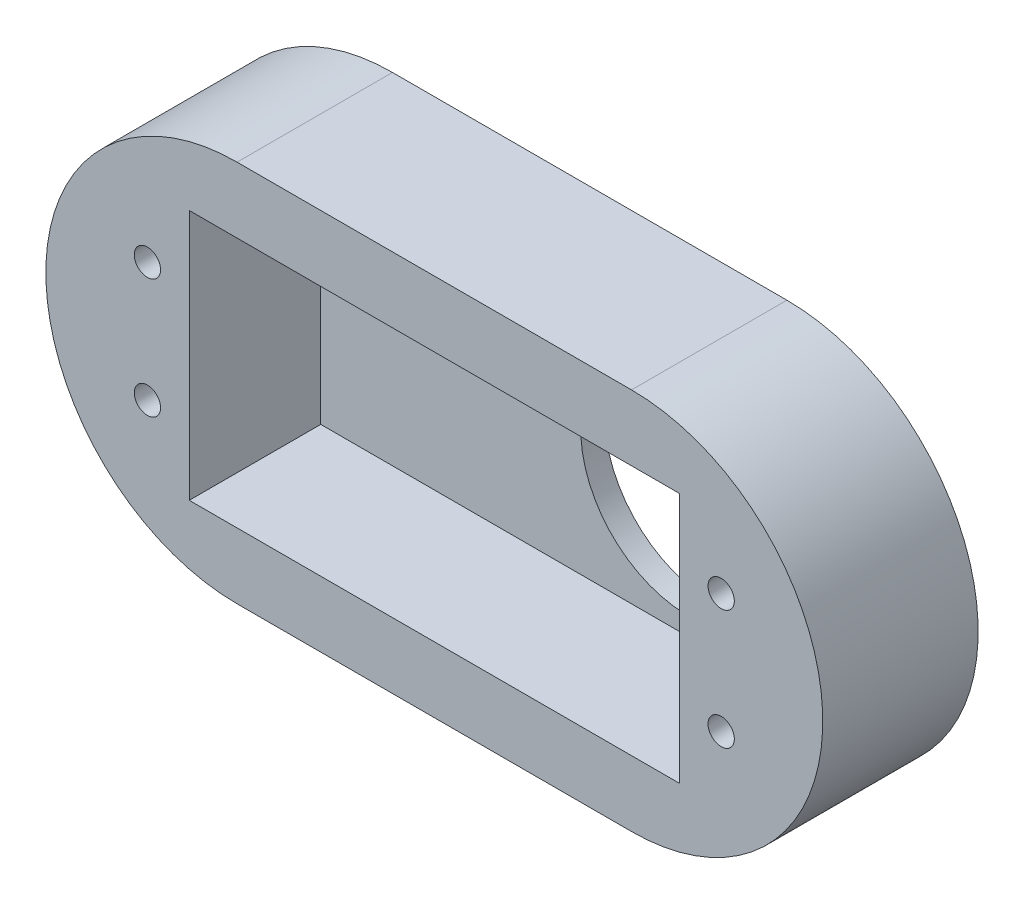
ISO-10303-21;
HEADER;
FILE_DESCRIPTION(('STEP AP214'),'2;1');
FILE_NAME('part.step','',(''),(''),'','','');
FILE_SCHEMA(('AUTOMOTIVE_DESIGN { 1 0 10303 214 1 1 1 1 }'));
ENDSEC;
DATA;
#1=APPLICATION_CONTEXT('core data for automotive mechanical design processes');
#2=APPLICATION_PROTOCOL_DEFINITION('international standard','automotive_design',2000,#1);
#3=PRODUCT_CONTEXT('',#1,'mechanical');
#4=PRODUCT('Part','Part','',(#3));
#5=PRODUCT_RELATED_PRODUCT_CATEGORY('part','',(#4));
#6=PRODUCT_DEFINITION_FORMATION('','',#4);
#7=PRODUCT_DEFINITION_CONTEXT('part definition',#1,'design');
#8=PRODUCT_DEFINITION('design','',#6,#7);
#9=PRODUCT_DEFINITION_SHAPE('','',#8);
#10=(LENGTH_UNIT() NAMED_UNIT(*) SI_UNIT(.MILLI.,.METRE.));
#11=(NAMED_UNIT(*) PLANE_ANGLE_UNIT() SI_UNIT($,.RADIAN.));
#12=(NAMED_UNIT(*) SI_UNIT($,.STERADIAN.) SOLID_ANGLE_UNIT());
#13=UNCERTAINTY_MEASURE_WITH_UNIT(LENGTH_MEASURE(1.E-05),#10,'distance_accuracy_value','');
#14=(GEOMETRIC_REPRESENTATION_CONTEXT(3) GLOBAL_UNCERTAINTY_ASSIGNED_CONTEXT((#13)) GLOBAL_UNIT_ASSIGNED_CONTEXT((#10,
#11,#12)) REPRESENTATION_CONTEXT('',''));
#15=CARTESIAN_POINT('',(0.,0.,0.));
#16=DIRECTION('',(0.,0.,1.));
#17=DIRECTION('',(1.,0.,0.));
#18=AXIS2_PLACEMENT_3D('',#15,#16,#17);
#19=CARTESIAN_POINT('',(3.99999999999999,10.5,11.));
#20=DIRECTION('',(0.,0.,1.));
#21=DIRECTION('',(1.,0.,0.));
#22=AXIS2_PLACEMENT_3D('',#19,#20,#21);
#23=PLANE('',#22);
#24=CARTESIAN_POINT('',(44.5,5.5,11.));
#25=DIRECTION('',(0.,0.,1.));
#26=DIRECTION('',(1.,0.,0.));
#27=AXIS2_PLACEMENT_3D('',#24,#25,#26);
#28=CIRCLE('',#27,1.1);
#29=CARTESIAN_POINT('',(45.6,5.5,11.));
#30=VERTEX_POINT('',#29);
#31=EDGE_CURVE('E152',#30,#30,#28,.T.);
#32=ORIENTED_EDGE('',*,*,#31,.F.);
#33=EDGE_LOOP('',(#32));
#34=FACE_BOUND('',#33,.T.);
#35=CARTESIAN_POINT('',(-3.5,15.5,11.));
#36=DIRECTION('',(0.,0.,1.));
#37=DIRECTION('',(1.,0.,0.));
#38=AXIS2_PLACEMENT_3D('',#35,#36,#37);
#39=CIRCLE('',#38,1.1);
#40=CARTESIAN_POINT('',(-2.4,15.5,11.));
#41=VERTEX_POINT('',#40);
#42=EDGE_CURVE('E168',#41,#41,#39,.T.);
#43=ORIENTED_EDGE('',*,*,#42,.F.);
#44=EDGE_LOOP('',(#43));
#45=FACE_BOUND('',#44,.T.);
#46=CARTESIAN_POINT('',(3.99999999999999,10.5,11.));
#47=DIRECTION('',(0.,0.,1.));
#48=DIRECTION('',(1.,0.,0.));
#49=AXIS2_PLACEMENT_3D('',#46,#47,#48);
#50=CIRCLE('',#49,16.000000004);
#51=CARTESIAN_POINT('',(4.,26.500000004,11.));
#52=VERTEX_POINT('',#51);
#53=CARTESIAN_POINT('',(3.99999999999999,-5.500000004,11.));
#54=VERTEX_POINT('',#53);
#55=EDGE_CURVE('E215',#52,#54,#50,.T.);
#56=ORIENTED_EDGE('',*,*,#55,.T.);
#57=DIRECTION('',(1.,0.,0.));
#58=VECTOR('',#57,1.);
#59=CARTESIAN_POINT('',(3.99999999999999,-5.500000004,11.));
#60=LINE('',#59,#58);
#61=CARTESIAN_POINT('',(37.,-5.500000004,11.));
#62=VERTEX_POINT('',#61);
#63=EDGE_CURVE('E113',#54,#62,#60,.T.);
#64=ORIENTED_EDGE('',*,*,#63,.T.);
#65=CARTESIAN_POINT('',(37.,10.5,11.));
#66=DIRECTION('',(0.,0.,1.));
#67=DIRECTION('',(1.,0.,0.));
#68=AXIS2_PLACEMENT_3D('',#65,#66,#67);
#69=CIRCLE('',#68,16.000000004);
#70=CARTESIAN_POINT('',(37.,26.500000004,11.));
#71=VERTEX_POINT('',#70);
#72=EDGE_CURVE('E220',#62,#71,#69,.T.);
#73=ORIENTED_EDGE('',*,*,#72,.T.);
#74=DIRECTION('',(-1.,0.,0.));
#75=VECTOR('',#74,1.);
#76=CARTESIAN_POINT('',(4.,26.500000004,11.));
#77=LINE('',#76,#75);
#78=EDGE_CURVE('E67',#71,#52,#77,.T.);
#79=ORIENTED_EDGE('',*,*,#78,.T.);
#80=EDGE_LOOP('',(#56,#64,#73,#79));
#81=FACE_BOUND('',#80,.T.);
#82=DIRECTION('',(1.,0.,0.));
#83=VECTOR('',#82,1.);
#84=CARTESIAN_POINT('',(0.,0.,11.));
#85=LINE('',#84,#83);
#86=CARTESIAN_POINT('',(0.,0.,11.));
#87=VERTEX_POINT('',#86);
#88=CARTESIAN_POINT('',(41.,0.,11.));
#89=VERTEX_POINT('',#88);
#90=EDGE_CURVE('E179',#87,#89,#85,.T.);
#91=ORIENTED_EDGE('',*,*,#90,.F.);
#92=DIRECTION('',(0.,-1.,0.));
#93=VECTOR('',#92,1.);
#94=CARTESIAN_POINT('',(0.,0.,11.));
#95=LINE('',#94,#93);
#96=CARTESIAN_POINT('',(0.,21.,11.));
#97=VERTEX_POINT('',#96);
#98=EDGE_CURVE('E176',#97,#87,#95,.T.);
#99=ORIENTED_EDGE('',*,*,#98,.F.);
#100=DIRECTION('',(-1.,0.,0.));
#101=VECTOR('',#100,1.);
#102=CARTESIAN_POINT('',(0.,21.,11.));
#103=LINE('',#102,#101);
#104=CARTESIAN_POINT('',(41.,21.,11.));
#105=VERTEX_POINT('',#104);
#106=EDGE_CURVE('E186',#105,#97,#103,.T.);
#107=ORIENTED_EDGE('',*,*,#106,.F.);
#108=DIRECTION('',(0.,1.,0.));
#109=VECTOR('',#108,1.);
#110=CARTESIAN_POINT('',(41.,0.,11.));
#111=LINE('',#110,#109);
#112=EDGE_CURVE('E183',#89,#105,#111,.T.);
#113=ORIENTED_EDGE('',*,*,#112,.F.);
#114=EDGE_LOOP('',(#91,#99,#107,#113));
#115=FACE_BOUND('',#114,.T.);
#116=CARTESIAN_POINT('',(-3.5,5.5,11.));
#117=DIRECTION('',(0.,0.,1.));
#118=DIRECTION('',(1.,0.,0.));
#119=AXIS2_PLACEMENT_3D('',#116,#117,#118);
#120=CIRCLE('',#119,1.1);
#121=CARTESIAN_POINT('',(-2.4,5.5,11.));
#122=VERTEX_POINT('',#121);
#123=EDGE_CURVE('E160',#122,#122,#120,.T.);
#124=ORIENTED_EDGE('',*,*,#123,.F.);
#125=EDGE_LOOP('',(#124));
#126=FACE_BOUND('',#125,.T.);
#127=CARTESIAN_POINT('',(44.5,15.5,11.));
#128=DIRECTION('',(0.,0.,1.));
#129=DIRECTION('',(1.,0.,0.));
#130=AXIS2_PLACEMENT_3D('',#127,#128,#129);
#131=CIRCLE('',#130,1.1);
#132=CARTESIAN_POINT('',(45.6,15.5,11.));
#133=VERTEX_POINT('',#132);
#134=EDGE_CURVE('E144',#133,#133,#131,.T.);
#135=ORIENTED_EDGE('',*,*,#134,.F.);
#136=EDGE_LOOP('',(#135));
#137=FACE_BOUND('',#136,.T.);
#138=ADVANCED_FACE('F43',(#34,#45,#81,#115,#126,#137),#23,.T.);
#139=CARTESIAN_POINT('',(3.99999999999999,10.5,11.));
#140=DIRECTION('',(0.,0.,-1.));
#141=DIRECTION('',(-1.,0.,0.));
#142=AXIS2_PLACEMENT_3D('',#139,#140,#141);
#143=CYLINDRICAL_SURFACE('',#142,16.000000004);
#144=DIRECTION('',(0.,0.,-1.));
#145=VECTOR('',#144,1.);
#146=CARTESIAN_POINT('',(4.,26.500000004,11.));
#147=LINE('',#146,#145);
#148=CARTESIAN_POINT('',(3.99999999999999,26.500000004,-2.));
#149=VERTEX_POINT('',#148);
#150=EDGE_CURVE('E128',#52,#149,#147,.T.);
#151=ORIENTED_EDGE('',*,*,#150,.T.);
#152=CARTESIAN_POINT('',(3.99999999999999,10.5,-2.));
#153=DIRECTION('',(0.,0.,1.));
#154=DIRECTION('',(1.,0.,0.));
#155=AXIS2_PLACEMENT_3D('',#152,#153,#154);
#156=CIRCLE('',#155,16.000000004);
#157=CARTESIAN_POINT('',(3.99999999999999,-5.500000004,-2.));
#158=VERTEX_POINT('',#157);
#159=EDGE_CURVE('E122',#149,#158,#156,.T.);
#160=ORIENTED_EDGE('',*,*,#159,.T.);
#161=DIRECTION('',(0.,0.,-1.));
#162=VECTOR('',#161,1.);
#163=CARTESIAN_POINT('',(3.99999999999999,-5.500000004,11.));
#164=LINE('',#163,#162);
#165=EDGE_CURVE('E11',#54,#158,#164,.T.);
#166=ORIENTED_EDGE('',*,*,#165,.F.);
#167=ORIENTED_EDGE('',*,*,#55,.F.);
#168=EDGE_LOOP('',(#151,#160,#166,#167));
#169=FACE_BOUND('',#168,.T.);
#170=ADVANCED_FACE('F45',(#169),#143,.T.);
#171=CARTESIAN_POINT('',(3.99999999999999,-5.500000004,11.));
#172=DIRECTION('',(0.,1.,0.));
#173=DIRECTION('',(0.,0.,1.));
#174=AXIS2_PLACEMENT_3D('',#171,#172,#173);
#175=PLANE('',#174);
#176=ORIENTED_EDGE('',*,*,#165,.T.);
#177=DIRECTION('',(1.,0.,0.));
#178=VECTOR('',#177,1.);
#179=CARTESIAN_POINT('',(3.99999999999999,-5.500000004,-2.));
#180=LINE('',#179,#178);
#181=CARTESIAN_POINT('',(37.,-5.500000004,-2.));
#182=VERTEX_POINT('',#181);
#183=EDGE_CURVE('E112',#158,#182,#180,.T.);
#184=ORIENTED_EDGE('',*,*,#183,.T.);
#185=DIRECTION('',(0.,0.,-1.));
#186=VECTOR('',#185,1.);
#187=CARTESIAN_POINT('',(37.,-5.500000004,11.));
#188=LINE('',#187,#186);
#189=EDGE_CURVE('E52',#62,#182,#188,.T.);
#190=ORIENTED_EDGE('',*,*,#189,.F.);
#191=ORIENTED_EDGE('',*,*,#63,.F.);
#192=EDGE_LOOP('',(#176,#184,#190,#191));
#193=FACE_BOUND('',#192,.T.);
#194=ADVANCED_FACE('F110',(#193),#175,.F.);
#195=CARTESIAN_POINT('',(37.,10.5,11.));
#196=DIRECTION('',(0.,0.,-1.));
#197=DIRECTION('',(-1.,0.,0.));
#198=AXIS2_PLACEMENT_3D('',#195,#196,#197);
#199=CYLINDRICAL_SURFACE('',#198,16.000000004);
#200=ORIENTED_EDGE('',*,*,#189,.T.);
#201=CARTESIAN_POINT('',(37.,10.5,-2.));
#202=DIRECTION('',(0.,0.,1.));
#203=DIRECTION('',(1.,0.,0.));
#204=AXIS2_PLACEMENT_3D('',#201,#202,#203);
#205=CIRCLE('',#204,16.000000004);
#206=CARTESIAN_POINT('',(37.,26.500000004,-2.));
#207=VERTEX_POINT('',#206);
#208=EDGE_CURVE('E125',#182,#207,#205,.T.);
#209=ORIENTED_EDGE('',*,*,#208,.T.);
#210=DIRECTION('',(0.,0.,-1.));
#211=VECTOR('',#210,1.);
#212=CARTESIAN_POINT('',(37.,26.500000004,11.));
#213=LINE('',#212,#211);
#214=EDGE_CURVE('E227',#71,#207,#213,.T.);
#215=ORIENTED_EDGE('',*,*,#214,.F.);
#216=ORIENTED_EDGE('',*,*,#72,.F.);
#217=EDGE_LOOP('',(#200,#209,#215,#216));
#218=FACE_BOUND('',#217,.T.);
#219=ADVANCED_FACE('F232',(#218),#199,.T.);
#220=CARTESIAN_POINT('',(4.,26.500000004,11.));
#221=DIRECTION('',(0.,-1.,0.));
#222=DIRECTION('',(0.,0.,-1.));
#223=AXIS2_PLACEMENT_3D('',#220,#221,#222);
#224=PLANE('',#223);
#225=ORIENTED_EDGE('',*,*,#214,.T.);
#226=DIRECTION('',(-1.,0.,0.));
#227=VECTOR('',#226,1.);
#228=CARTESIAN_POINT('',(37.,26.500000004,-2.));
#229=LINE('',#228,#227);
#230=EDGE_CURVE('E140',#207,#149,#229,.T.);
#231=ORIENTED_EDGE('',*,*,#230,.T.);
#232=ORIENTED_EDGE('',*,*,#150,.F.);
#233=ORIENTED_EDGE('',*,*,#78,.F.);
#234=EDGE_LOOP('',(#225,#231,#232,#233));
#235=FACE_BOUND('',#234,.T.);
#236=ADVANCED_FACE('F302',(#235),#224,.F.);
#237=CARTESIAN_POINT('',(0.,0.,11.));
#238=DIRECTION('',(1.,0.,0.));
#239=DIRECTION('',(0.,0.,-1.));
#240=AXIS2_PLACEMENT_3D('',#237,#238,#239);
#241=PLANE('',#240);
#242=DIRECTION('',(0.,-1.,0.));
#243=VECTOR('',#242,1.);
#244=CARTESIAN_POINT('',(0.,0.,0.));
#245=LINE('',#244,#243);
#246=CARTESIAN_POINT('',(0.,21.,0.));
#247=VERTEX_POINT('',#246);
#248=CARTESIAN_POINT('',(0.,0.,0.));
#249=VERTEX_POINT('',#248);
#250=EDGE_CURVE('E172',#247,#249,#245,.T.);
#251=ORIENTED_EDGE('',*,*,#250,.F.);
#252=DIRECTION('',(0.,0.,-1.));
#253=VECTOR('',#252,1.);
#254=CARTESIAN_POINT('',(0.,21.,11.));
#255=LINE('',#254,#253);
#256=EDGE_CURVE('E189',#97,#247,#255,.T.);
#257=ORIENTED_EDGE('',*,*,#256,.F.);
#258=ORIENTED_EDGE('',*,*,#98,.T.);
#259=DIRECTION('',(0.,0.,-1.));
#260=VECTOR('',#259,1.);
#261=CARTESIAN_POINT('',(0.,0.,11.));
#262=LINE('',#261,#260);
#263=EDGE_CURVE('E211',#87,#249,#262,.T.);
#264=ORIENTED_EDGE('',*,*,#263,.T.);
#265=EDGE_LOOP('',(#251,#257,#258,#264));
#266=FACE_BOUND('',#265,.T.);
#267=ADVANCED_FACE('F283',(#266),#241,.T.);
#268=CARTESIAN_POINT('',(0.,0.,11.));
#269=DIRECTION('',(0.,1.,0.));
#270=DIRECTION('',(0.,0.,1.));
#271=AXIS2_PLACEMENT_3D('',#268,#269,#270);
#272=PLANE('',#271);
#273=DIRECTION('',(1.,0.,0.));
#274=VECTOR('',#273,1.);
#275=CARTESIAN_POINT('',(0.,0.,0.));
#276=LINE('',#275,#274);
#277=CARTESIAN_POINT('',(41.,0.,0.));
#278=VERTEX_POINT('',#277);
#279=EDGE_CURVE('E193',#249,#278,#276,.T.);
#280=ORIENTED_EDGE('',*,*,#279,.F.);
#281=ORIENTED_EDGE('',*,*,#263,.F.);
#282=ORIENTED_EDGE('',*,*,#90,.T.);
#283=DIRECTION('',(0.,0.,-1.));
#284=VECTOR('',#283,1.);
#285=CARTESIAN_POINT('',(41.,0.,11.));
#286=LINE('',#285,#284);
#287=EDGE_CURVE('E208',#89,#278,#286,.T.);
#288=ORIENTED_EDGE('',*,*,#287,.T.);
#289=EDGE_LOOP('',(#280,#281,#282,#288));
#290=FACE_BOUND('',#289,.T.);
#291=ADVANCED_FACE('F286',(#290),#272,.T.);
#292=CARTESIAN_POINT('',(41.,0.,11.));
#293=DIRECTION('',(-1.,0.,0.));
#294=DIRECTION('',(0.,0.,1.));
#295=AXIS2_PLACEMENT_3D('',#292,#293,#294);
#296=PLANE('',#295);
#297=DIRECTION('',(0.,1.,0.));
#298=VECTOR('',#297,1.);
#299=CARTESIAN_POINT('',(41.,0.,0.));
#300=LINE('',#299,#298);
#301=CARTESIAN_POINT('',(41.,21.,0.));
#302=VERTEX_POINT('',#301);
#303=EDGE_CURVE('E197',#278,#302,#300,.T.);
#304=ORIENTED_EDGE('',*,*,#303,.F.);
#305=ORIENTED_EDGE('',*,*,#287,.F.);
#306=ORIENTED_EDGE('',*,*,#112,.T.);
#307=DIRECTION('',(0.,0.,-1.));
#308=VECTOR('',#307,1.);
#309=CARTESIAN_POINT('',(41.,21.,11.));
#310=LINE('',#309,#308);
#311=EDGE_CURVE('E59',#105,#302,#310,.T.);
#312=ORIENTED_EDGE('',*,*,#311,.T.);
#313=EDGE_LOOP('',(#304,#305,#306,#312));
#314=FACE_BOUND('',#313,.T.);
#315=ADVANCED_FACE('F289',(#314),#296,.T.);
#316=CARTESIAN_POINT('',(0.,21.,11.));
#317=DIRECTION('',(0.,-1.,0.));
#318=DIRECTION('',(0.,0.,-1.));
#319=AXIS2_PLACEMENT_3D('',#316,#317,#318);
#320=PLANE('',#319);
#321=DIRECTION('',(-1.,0.,0.));
#322=VECTOR('',#321,1.);
#323=CARTESIAN_POINT('',(0.,21.,0.));
#324=LINE('',#323,#322);
#325=EDGE_CURVE('E180',#302,#247,#324,.T.);
#326=ORIENTED_EDGE('',*,*,#325,.F.);
#327=ORIENTED_EDGE('',*,*,#311,.F.);
#328=ORIENTED_EDGE('',*,*,#106,.T.);
#329=ORIENTED_EDGE('',*,*,#256,.T.);
#330=EDGE_LOOP('',(#326,#327,#328,#329));
#331=FACE_BOUND('',#330,.T.);
#332=ADVANCED_FACE('F279',(#331),#320,.T.);
#333=CARTESIAN_POINT('',(-3.5,15.5,11.));
#334=DIRECTION('',(0.,0.,-1.));
#335=DIRECTION('',(-1.,0.,0.));
#336=AXIS2_PLACEMENT_3D('',#333,#334,#335);
#337=CYLINDRICAL_SURFACE('',#336,1.1);
#338=ORIENTED_EDGE('',*,*,#42,.T.);
#339=EDGE_LOOP('',(#338));
#340=FACE_BOUND('',#339,.T.);
#341=CARTESIAN_POINT('',(-3.5,15.5,0.));
#342=DIRECTION('',(0.,0.,1.));
#343=DIRECTION('',(1.,0.,0.));
#344=AXIS2_PLACEMENT_3D('',#341,#342,#343);
#345=CIRCLE('',#344,1.1);
#346=CARTESIAN_POINT('',(-2.4,15.5,0.));
#347=VERTEX_POINT('',#346);
#348=EDGE_CURVE('E164',#347,#347,#345,.T.);
#349=ORIENTED_EDGE('',*,*,#348,.F.);
#350=EDGE_LOOP('',(#349));
#351=FACE_BOUND('',#350,.T.);
#352=ADVANCED_FACE('F296',(#340,#351),#337,.F.);
#353=CARTESIAN_POINT('',(-3.5,5.5,11.));
#354=DIRECTION('',(0.,0.,-1.));
#355=DIRECTION('',(-1.,0.,0.));
#356=AXIS2_PLACEMENT_3D('',#353,#354,#355);
#357=CYLINDRICAL_SURFACE('',#356,1.1);
#358=ORIENTED_EDGE('',*,*,#123,.T.);
#359=EDGE_LOOP('',(#358));
#360=FACE_BOUND('',#359,.T.);
#361=CARTESIAN_POINT('',(-3.5,5.5,0.));
#362=DIRECTION('',(0.,0.,1.));
#363=DIRECTION('',(1.,0.,0.));
#364=AXIS2_PLACEMENT_3D('',#361,#362,#363);
#365=CIRCLE('',#364,1.1);
#366=CARTESIAN_POINT('',(-2.4,5.5,0.));
#367=VERTEX_POINT('',#366);
#368=EDGE_CURVE('E156',#367,#367,#365,.T.);
#369=ORIENTED_EDGE('',*,*,#368,.F.);
#370=EDGE_LOOP('',(#369));
#371=FACE_BOUND('',#370,.T.);
#372=ADVANCED_FACE('F330',(#360,#371),#357,.F.);
#373=CARTESIAN_POINT('',(44.5,5.5,11.));
#374=DIRECTION('',(0.,0.,-1.));
#375=DIRECTION('',(-1.,0.,0.));
#376=AXIS2_PLACEMENT_3D('',#373,#374,#375);
#377=CYLINDRICAL_SURFACE('',#376,1.1);
#378=ORIENTED_EDGE('',*,*,#31,.T.);
#379=EDGE_LOOP('',(#378));
#380=FACE_BOUND('',#379,.T.);
#381=CARTESIAN_POINT('',(44.5,5.5,0.));
#382=DIRECTION('',(0.,0.,1.));
#383=DIRECTION('',(1.,0.,0.));
#384=AXIS2_PLACEMENT_3D('',#381,#382,#383);
#385=CIRCLE('',#384,1.1);
#386=CARTESIAN_POINT('',(45.6,5.5,0.));
#387=VERTEX_POINT('',#386);
#388=EDGE_CURVE('E148',#387,#387,#385,.T.);
#389=ORIENTED_EDGE('',*,*,#388,.F.);
#390=EDGE_LOOP('',(#389));
#391=FACE_BOUND('',#390,.T.);
#392=ADVANCED_FACE('F250',(#380,#391),#377,.F.);
#393=CARTESIAN_POINT('',(44.5,15.5,11.));
#394=DIRECTION('',(0.,0.,-1.));
#395=DIRECTION('',(-1.,0.,0.));
#396=AXIS2_PLACEMENT_3D('',#393,#394,#395);
#397=CYLINDRICAL_SURFACE('',#396,1.1);
#398=ORIENTED_EDGE('',*,*,#134,.T.);
#399=EDGE_LOOP('',(#398));
#400=FACE_BOUND('',#399,.T.);
#401=CARTESIAN_POINT('',(44.5,15.5,0.));
#402=DIRECTION('',(0.,0.,1.));
#403=DIRECTION('',(1.,0.,0.));
#404=AXIS2_PLACEMENT_3D('',#401,#402,#403);
#405=CIRCLE('',#404,1.1);
#406=CARTESIAN_POINT('',(45.6,15.5,0.));
#407=VERTEX_POINT('',#406);
#408=EDGE_CURVE('E143',#407,#407,#405,.T.);
#409=ORIENTED_EDGE('',*,*,#408,.F.);
#410=EDGE_LOOP('',(#409));
#411=FACE_BOUND('',#410,.T.);
#412=ADVANCED_FACE('F246',(#400,#411),#397,.F.);
#413=CARTESIAN_POINT('',(3.99999999999999,10.5,0.));
#414=DIRECTION('',(0.,0.,1.));
#415=DIRECTION('',(1.,0.,0.));
#416=AXIS2_PLACEMENT_3D('',#413,#414,#415);
#417=PLANE('',#416);
#418=ORIENTED_EDGE('',*,*,#408,.T.);
#419=EDGE_LOOP('',(#418));
#420=FACE_BOUND('',#419,.T.);
#421=ADVANCED_FACE('F249',(#420),#417,.T.);
#422=ORIENTED_EDGE('',*,*,#388,.T.);
#423=EDGE_LOOP('',(#422));
#424=FACE_BOUND('',#423,.T.);
#425=ADVANCED_FACE('F255',(#424),#417,.T.);
#426=ORIENTED_EDGE('',*,*,#368,.T.);
#427=EDGE_LOOP('',(#426));
#428=FACE_BOUND('',#427,.T.);
#429=ADVANCED_FACE('F261',(#428),#417,.T.);
#430=ORIENTED_EDGE('',*,*,#348,.T.);
#431=EDGE_LOOP('',(#430));
#432=FACE_BOUND('',#431,.T.);
#433=ADVANCED_FACE('F265',(#432),#417,.T.);
#434=CARTESIAN_POINT('',(30.749999966,10.5,0.));
#435=DIRECTION('',(0.,0.,1.));
#436=DIRECTION('',(1.,0.,0.));
#437=AXIS2_PLACEMENT_3D('',#434,#435,#436);
#438=CIRCLE('',#437,9.000000034);
#439=CARTESIAN_POINT('',(39.75,10.5,0.));
#440=VERTEX_POINT('',#439);
#441=EDGE_CURVE('E134',#440,#440,#438,.T.);
#442=ORIENTED_EDGE('',*,*,#441,.F.);
#443=EDGE_LOOP('',(#442));
#444=FACE_BOUND('',#443,.T.);
#445=ORIENTED_EDGE('',*,*,#325,.T.);
#446=ORIENTED_EDGE('',*,*,#250,.T.);
#447=ORIENTED_EDGE('',*,*,#279,.T.);
#448=ORIENTED_EDGE('',*,*,#303,.T.);
#449=EDGE_LOOP('',(#445,#446,#447,#448));
#450=FACE_BOUND('',#449,.T.);
#451=ADVANCED_FACE('F257',(#444,#450),#417,.T.);
#452=CARTESIAN_POINT('',(3.99999999999999,10.5,-2.));
#453=DIRECTION('',(0.,0.,1.));
#454=DIRECTION('',(1.,0.,0.));
#455=AXIS2_PLACEMENT_3D('',#452,#453,#454);
#456=PLANE('',#455);
#457=CARTESIAN_POINT('',(30.749999966,10.5,-2.));
#458=DIRECTION('',(0.,0.,1.));
#459=DIRECTION('',(1.,0.,0.));
#460=AXIS2_PLACEMENT_3D('',#457,#458,#459);
#461=CIRCLE('',#460,9.000000034);
#462=CARTESIAN_POINT('',(39.75,10.5,-2.));
#463=VERTEX_POINT('',#462);
#464=EDGE_CURVE('E130',#463,#463,#461,.T.);
#465=ORIENTED_EDGE('',*,*,#464,.T.);
#466=EDGE_LOOP('',(#465));
#467=FACE_BOUND('',#466,.T.);
#468=ORIENTED_EDGE('',*,*,#159,.F.);
#469=ORIENTED_EDGE('',*,*,#230,.F.);
#470=ORIENTED_EDGE('',*,*,#208,.F.);
#471=ORIENTED_EDGE('',*,*,#183,.F.);
#472=EDGE_LOOP('',(#468,#469,#470,#471));
#473=FACE_BOUND('',#472,.T.);
#474=ADVANCED_FACE('F120',(#467,#473),#456,.F.);
#475=CARTESIAN_POINT('',(30.749999966,10.5,-2.));
#476=DIRECTION('',(0.,0.,1.));
#477=DIRECTION('',(1.,0.,0.));
#478=AXIS2_PLACEMENT_3D('',#475,#476,#477);
#479=CYLINDRICAL_SURFACE('',#478,9.000000034);
#480=ORIENTED_EDGE('',*,*,#464,.F.);
#481=EDGE_LOOP('',(#480));
#482=FACE_BOUND('',#481,.T.);
#483=ORIENTED_EDGE('',*,*,#441,.T.);
#484=EDGE_LOOP('',(#483));
#485=FACE_BOUND('',#484,.T.);
#486=ADVANCED_FACE('F271',(#482,#485),#479,.F.);
#487=CLOSED_SHELL('',(#138,#170,#194,#219,#236,#267,#291,#315,#332,#352,#372,#392,#412,#421,
#425,#429,#433,#451,#474,#486));
#488=MANIFOLD_SOLID_BREP('B2',#487);
#489=ADVANCED_BREP_SHAPE_REPRESENTATION('',(#18,#488),#14);
#490=SHAPE_DEFINITION_REPRESENTATION(#9,#489);
ENDSEC;
END-ISO-10303-21;
